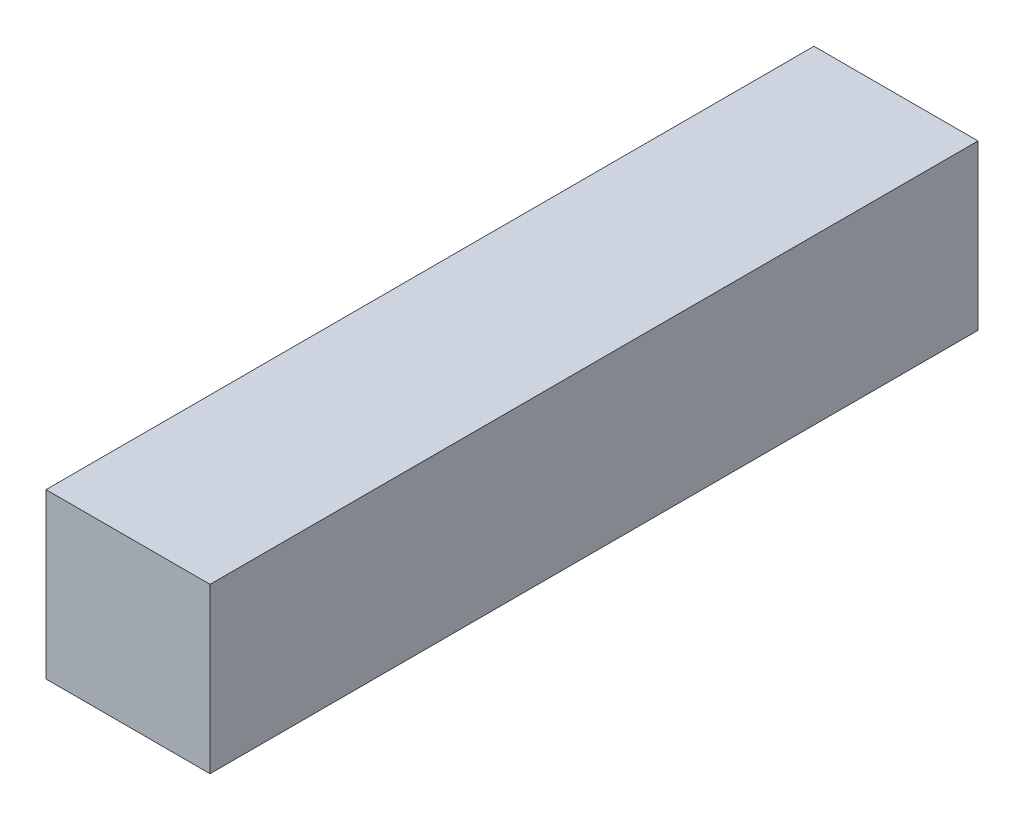
ISO-10303-21;
HEADER;
FILE_DESCRIPTION(('STEP AP214'),'2;1');
FILE_NAME('part.step','',(''),(''),'','','');
FILE_SCHEMA(('AUTOMOTIVE_DESIGN { 1 0 10303 214 1 1 1 1 }'));
ENDSEC;
DATA;
#1=APPLICATION_CONTEXT('core data for automotive mechanical design processes');
#2=APPLICATION_PROTOCOL_DEFINITION('international standard','automotive_design',2000,#1);
#3=PRODUCT_CONTEXT('',#1,'mechanical');
#4=PRODUCT('Part','Part','',(#3));
#5=PRODUCT_RELATED_PRODUCT_CATEGORY('part','',(#4));
#6=PRODUCT_DEFINITION_FORMATION('','',#4);
#7=PRODUCT_DEFINITION_CONTEXT('part definition',#1,'design');
#8=PRODUCT_DEFINITION('design','',#6,#7);
#9=PRODUCT_DEFINITION_SHAPE('','',#8);
#10=(LENGTH_UNIT() NAMED_UNIT(*) SI_UNIT(.MILLI.,.METRE.));
#11=(NAMED_UNIT(*) PLANE_ANGLE_UNIT() SI_UNIT($,.RADIAN.));
#12=(NAMED_UNIT(*) SI_UNIT($,.STERADIAN.) SOLID_ANGLE_UNIT());
#13=UNCERTAINTY_MEASURE_WITH_UNIT(LENGTH_MEASURE(1.E-05),#10,'distance_accuracy_value','');
#14=(GEOMETRIC_REPRESENTATION_CONTEXT(3) GLOBAL_UNCERTAINTY_ASSIGNED_CONTEXT((#13)) GLOBAL_UNIT_ASSIGNED_CONTEXT((#10,
#11,#12)) REPRESENTATION_CONTEXT('',''));
#15=CARTESIAN_POINT('',(0.,0.,0.));
#16=DIRECTION('',(0.,0.,1.));
#17=DIRECTION('',(1.,0.,0.));
#18=AXIS2_PLACEMENT_3D('',#15,#16,#17);
#19=CARTESIAN_POINT('',(0.,0.,-103.));
#20=DIRECTION('',(-1.,0.,0.));
#21=DIRECTION('',(0.,0.,1.));
#22=AXIS2_PLACEMENT_3D('',#19,#20,#21);
#23=PLANE('',#22);
#24=DIRECTION('',(0.,-1.,0.));
#25=VECTOR('',#24,1.);
#26=CARTESIAN_POINT('',(0.,0.,0.));
#27=LINE('',#26,#25);
#28=CARTESIAN_POINT('',(0.,22.,0.));
#29=VERTEX_POINT('',#28);
#30=CARTESIAN_POINT('',(0.,0.,0.));
#31=VERTEX_POINT('',#30);
#32=EDGE_CURVE('E95',#29,#31,#27,.T.);
#33=ORIENTED_EDGE('',*,*,#32,.F.);
#34=DIRECTION('',(0.,0.,1.));
#35=VECTOR('',#34,1.);
#36=CARTESIAN_POINT('',(0.,22.,-103.));
#37=LINE('',#36,#35);
#38=CARTESIAN_POINT('',(0.,22.,-103.));
#39=VERTEX_POINT('',#38);
#40=EDGE_CURVE('E11',#39,#29,#37,.T.);
#41=ORIENTED_EDGE('',*,*,#40,.F.);
#42=DIRECTION('',(0.,-1.,0.));
#43=VECTOR('',#42,1.);
#44=CARTESIAN_POINT('',(0.,0.,-103.));
#45=LINE('',#44,#43);
#46=CARTESIAN_POINT('',(0.,0.,-103.));
#47=VERTEX_POINT('',#46);
#48=EDGE_CURVE('E89',#39,#47,#45,.T.);
#49=ORIENTED_EDGE('',*,*,#48,.T.);
#50=DIRECTION('',(0.,0.,1.));
#51=VECTOR('',#50,1.);
#52=CARTESIAN_POINT('',(0.,0.,-103.));
#53=LINE('',#52,#51);
#54=EDGE_CURVE('E34',#47,#31,#53,.T.);
#55=ORIENTED_EDGE('',*,*,#54,.T.);
#56=EDGE_LOOP('',(#33,#41,#49,#55));
#57=FACE_BOUND('',#56,.T.);
#58=ADVANCED_FACE('F31',(#57),#23,.T.);
#59=CARTESIAN_POINT('',(0.,22.,-103.));
#60=DIRECTION('',(0.,1.,0.));
#61=DIRECTION('',(0.,0.,1.));
#62=AXIS2_PLACEMENT_3D('',#59,#60,#61);
#63=PLANE('',#62);
#64=DIRECTION('',(-1.,0.,0.));
#65=VECTOR('',#64,1.);
#66=CARTESIAN_POINT('',(0.,22.,0.));
#67=LINE('',#66,#65);
#68=CARTESIAN_POINT('',(22.,22.,0.));
#69=VERTEX_POINT('',#68);
#70=EDGE_CURVE('E91',#69,#29,#67,.T.);
#71=ORIENTED_EDGE('',*,*,#70,.F.);
#72=DIRECTION('',(0.,0.,1.));
#73=VECTOR('',#72,1.);
#74=CARTESIAN_POINT('',(22.,22.,-103.));
#75=LINE('',#74,#73);
#76=CARTESIAN_POINT('',(22.,22.,-103.));
#77=VERTEX_POINT('',#76);
#78=EDGE_CURVE('E40',#77,#69,#75,.T.);
#79=ORIENTED_EDGE('',*,*,#78,.F.);
#80=DIRECTION('',(-1.,0.,0.));
#81=VECTOR('',#80,1.);
#82=CARTESIAN_POINT('',(0.,22.,-103.));
#83=LINE('',#82,#81);
#84=EDGE_CURVE('E86',#77,#39,#83,.T.);
#85=ORIENTED_EDGE('',*,*,#84,.T.);
#86=ORIENTED_EDGE('',*,*,#40,.T.);
#87=EDGE_LOOP('',(#71,#79,#85,#86));
#88=FACE_BOUND('',#87,.T.);
#89=ADVANCED_FACE('F105',(#88),#63,.T.);
#90=CARTESIAN_POINT('',(22.,0.,-103.));
#91=DIRECTION('',(1.,0.,0.));
#92=DIRECTION('',(0.,0.,-1.));
#93=AXIS2_PLACEMENT_3D('',#90,#91,#92);
#94=PLANE('',#93);
#95=DIRECTION('',(0.,1.,0.));
#96=VECTOR('',#95,1.);
#97=CARTESIAN_POINT('',(22.,0.,0.));
#98=LINE('',#97,#96);
#99=CARTESIAN_POINT('',(22.,0.,0.));
#100=VERTEX_POINT('',#99);
#101=EDGE_CURVE('E81',#100,#69,#98,.T.);
#102=ORIENTED_EDGE('',*,*,#101,.F.);
#103=DIRECTION('',(0.,0.,1.));
#104=VECTOR('',#103,1.);
#105=CARTESIAN_POINT('',(22.,0.,-103.));
#106=LINE('',#105,#104);
#107=CARTESIAN_POINT('',(22.,0.,-103.));
#108=VERTEX_POINT('',#107);
#109=EDGE_CURVE('E76',#108,#100,#106,.T.);
#110=ORIENTED_EDGE('',*,*,#109,.F.);
#111=DIRECTION('',(0.,1.,0.));
#112=VECTOR('',#111,1.);
#113=CARTESIAN_POINT('',(22.,0.,-103.));
#114=LINE('',#113,#112);
#115=EDGE_CURVE('E79',#108,#77,#114,.T.);
#116=ORIENTED_EDGE('',*,*,#115,.T.);
#117=ORIENTED_EDGE('',*,*,#78,.T.);
#118=EDGE_LOOP('',(#102,#110,#116,#117));
#119=FACE_BOUND('',#118,.T.);
#120=ADVANCED_FACE('F78',(#119),#94,.T.);
#121=CARTESIAN_POINT('',(0.,0.,-103.));
#122=DIRECTION('',(0.,-1.,0.));
#123=DIRECTION('',(0.,0.,-1.));
#124=AXIS2_PLACEMENT_3D('',#121,#122,#123);
#125=PLANE('',#124);
#126=DIRECTION('',(1.,0.,0.));
#127=VECTOR('',#126,1.);
#128=CARTESIAN_POINT('',(0.,0.,0.));
#129=LINE('',#128,#127);
#130=EDGE_CURVE('E98',#31,#100,#129,.T.);
#131=ORIENTED_EDGE('',*,*,#130,.F.);
#132=ORIENTED_EDGE('',*,*,#54,.F.);
#133=DIRECTION('',(1.,0.,0.));
#134=VECTOR('',#133,1.);
#135=CARTESIAN_POINT('',(0.,0.,-103.));
#136=LINE('',#135,#134);
#137=EDGE_CURVE('E85',#47,#108,#136,.T.);
#138=ORIENTED_EDGE('',*,*,#137,.T.);
#139=ORIENTED_EDGE('',*,*,#109,.T.);
#140=EDGE_LOOP('',(#131,#132,#138,#139));
#141=FACE_BOUND('',#140,.T.);
#142=ADVANCED_FACE('F88',(#141),#125,.T.);
#143=CARTESIAN_POINT('',(0.,22.,-103.));
#144=DIRECTION('',(0.,0.,-1.));
#145=DIRECTION('',(-1.,0.,0.));
#146=AXIS2_PLACEMENT_3D('',#143,#144,#145);
#147=PLANE('',#146);
#148=ORIENTED_EDGE('',*,*,#48,.F.);
#149=ORIENTED_EDGE('',*,*,#84,.F.);
#150=ORIENTED_EDGE('',*,*,#115,.F.);
#151=ORIENTED_EDGE('',*,*,#137,.F.);
#152=EDGE_LOOP('',(#148,#149,#150,#151));
#153=FACE_BOUND('',#152,.T.);
#154=ADVANCED_FACE('F84',(#153),#147,.T.);
#155=CARTESIAN_POINT('',(0.,22.,0.));
#156=DIRECTION('',(0.,0.,-1.));
#157=DIRECTION('',(-1.,0.,0.));
#158=AXIS2_PLACEMENT_3D('',#155,#156,#157);
#159=PLANE('',#158);
#160=ORIENTED_EDGE('',*,*,#32,.T.);
#161=ORIENTED_EDGE('',*,*,#130,.T.);
#162=ORIENTED_EDGE('',*,*,#101,.T.);
#163=ORIENTED_EDGE('',*,*,#70,.T.);
#164=EDGE_LOOP('',(#160,#161,#162,#163));
#165=FACE_BOUND('',#164,.T.);
#166=ADVANCED_FACE('F104',(#165),#159,.F.);
#167=CLOSED_SHELL('',(#58,#89,#120,#142,#154,#166));
#168=MANIFOLD_SOLID_BREP('B2',#167);
#169=ADVANCED_BREP_SHAPE_REPRESENTATION('',(#18,#168),#14);
#170=SHAPE_DEFINITION_REPRESENTATION(#9,#169);
ENDSEC;
END-ISO-10303-21;
